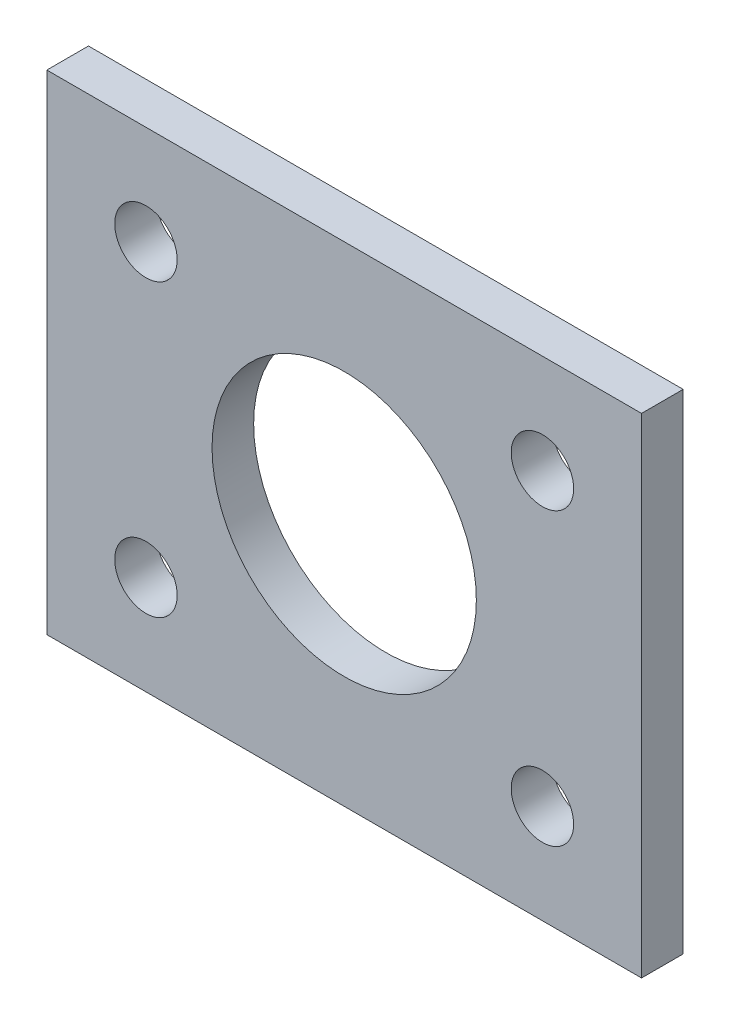
ISO-10303-21;
HEADER;
FILE_DESCRIPTION(('STEP AP214'),'2;1');
FILE_NAME('part.step','',(''),(''),'','','');
FILE_SCHEMA(('AUTOMOTIVE_DESIGN { 1 0 10303 214 1 1 1 1 }'));
ENDSEC;
DATA;
#1=APPLICATION_CONTEXT('core data for automotive mechanical design processes');
#2=APPLICATION_PROTOCOL_DEFINITION('international standard','automotive_design',2000,#1);
#3=PRODUCT_CONTEXT('',#1,'mechanical');
#4=PRODUCT('Part','Part','',(#3));
#5=PRODUCT_RELATED_PRODUCT_CATEGORY('part','',(#4));
#6=PRODUCT_DEFINITION_FORMATION('','',#4);
#7=PRODUCT_DEFINITION_CONTEXT('part definition',#1,'design');
#8=PRODUCT_DEFINITION('design','',#6,#7);
#9=PRODUCT_DEFINITION_SHAPE('','',#8);
#10=(LENGTH_UNIT() NAMED_UNIT(*) SI_UNIT(.MILLI.,.METRE.));
#11=(NAMED_UNIT(*) PLANE_ANGLE_UNIT() SI_UNIT($,.RADIAN.));
#12=(NAMED_UNIT(*) SI_UNIT($,.STERADIAN.) SOLID_ANGLE_UNIT());
#13=UNCERTAINTY_MEASURE_WITH_UNIT(LENGTH_MEASURE(1.E-05),#10,'distance_accuracy_value','');
#14=(GEOMETRIC_REPRESENTATION_CONTEXT(3) GLOBAL_UNCERTAINTY_ASSIGNED_CONTEXT((#13)) GLOBAL_UNIT_ASSIGNED_CONTEXT((#10,
#11,#12)) REPRESENTATION_CONTEXT('',''));
#15=CARTESIAN_POINT('',(0.,0.,0.));
#16=DIRECTION('',(0.,0.,1.));
#17=DIRECTION('',(1.,0.,0.));
#18=AXIS2_PLACEMENT_3D('',#15,#16,#17);
#19=CARTESIAN_POINT('',(0.,0.,2.));
#20=DIRECTION('',(0.,0.,1.));
#21=DIRECTION('',(1.,0.,0.));
#22=AXIS2_PLACEMENT_3D('',#19,#20,#21);
#23=PLANE('',#22);
#24=CARTESIAN_POINT('',(9.525,-6.985,2.));
#25=DIRECTION('',(0.,0.,1.));
#26=DIRECTION('',(1.,0.,0.));
#27=AXIS2_PLACEMENT_3D('',#24,#25,#26);
#28=CIRCLE('',#27,1.5);
#29=CARTESIAN_POINT('',(11.025,-6.985,2.));
#30=VERTEX_POINT('',#29);
#31=EDGE_CURVE('E131',#30,#30,#28,.T.);
#32=ORIENTED_EDGE('',*,*,#31,.F.);
#33=EDGE_LOOP('',(#32));
#34=FACE_BOUND('',#33,.T.);
#35=CARTESIAN_POINT('',(9.525,6.985,2.));
#36=DIRECTION('',(0.,0.,1.));
#37=DIRECTION('',(1.,0.,0.));
#38=AXIS2_PLACEMENT_3D('',#35,#36,#37);
#39=CIRCLE('',#38,1.5);
#40=CARTESIAN_POINT('',(11.025,6.985,2.));
#41=VERTEX_POINT('',#40);
#42=EDGE_CURVE('E119',#41,#41,#39,.T.);
#43=ORIENTED_EDGE('',*,*,#42,.F.);
#44=EDGE_LOOP('',(#43));
#45=FACE_BOUND('',#44,.T.);
#46=DIRECTION('',(0.,1.,0.));
#47=VECTOR('',#46,1.);
#48=CARTESIAN_POINT('',(14.2875,11.7475,2.));
#49=LINE('',#48,#47);
#50=CARTESIAN_POINT('',(14.2875,-11.7475,2.));
#51=VERTEX_POINT('',#50);
#52=CARTESIAN_POINT('',(14.2875,11.7475,2.));
#53=VERTEX_POINT('',#52);
#54=EDGE_CURVE('E89',#51,#53,#49,.T.);
#55=ORIENTED_EDGE('',*,*,#54,.T.);
#56=DIRECTION('',(-1.,0.,0.));
#57=VECTOR('',#56,1.);
#58=CARTESIAN_POINT('',(-14.2875,11.7475,2.));
#59=LINE('',#58,#57);
#60=CARTESIAN_POINT('',(-14.2875,11.7475,2.));
#61=VERTEX_POINT('',#60);
#62=EDGE_CURVE('E84',#53,#61,#59,.T.);
#63=ORIENTED_EDGE('',*,*,#62,.T.);
#64=DIRECTION('',(0.,-1.,0.));
#65=VECTOR('',#64,1.);
#66=CARTESIAN_POINT('',(-14.2875,11.7475,2.));
#67=LINE('',#66,#65);
#68=CARTESIAN_POINT('',(-14.2875,-11.7475,2.));
#69=VERTEX_POINT('',#68);
#70=EDGE_CURVE('E87',#61,#69,#67,.T.);
#71=ORIENTED_EDGE('',*,*,#70,.T.);
#72=DIRECTION('',(1.,0.,0.));
#73=VECTOR('',#72,1.);
#74=CARTESIAN_POINT('',(-14.2875,-11.7475,2.));
#75=LINE('',#74,#73);
#76=EDGE_CURVE('E54',#69,#51,#75,.T.);
#77=ORIENTED_EDGE('',*,*,#76,.T.);
#78=EDGE_LOOP('',(#55,#63,#71,#77));
#79=FACE_BOUND('',#78,.T.);
#80=CARTESIAN_POINT('',(-9.525,6.985,2.));
#81=DIRECTION('',(0.,0.,1.));
#82=DIRECTION('',(1.,0.,0.));
#83=AXIS2_PLACEMENT_3D('',#80,#81,#82);
#84=CIRCLE('',#83,1.5);
#85=CARTESIAN_POINT('',(-8.025,6.985,2.));
#86=VERTEX_POINT('',#85);
#87=EDGE_CURVE('E104',#86,#86,#84,.T.);
#88=ORIENTED_EDGE('',*,*,#87,.F.);
#89=EDGE_LOOP('',(#88));
#90=FACE_BOUND('',#89,.T.);
#91=CARTESIAN_POINT('',(-9.525,-6.985,2.));
#92=DIRECTION('',(0.,0.,1.));
#93=DIRECTION('',(1.,0.,0.));
#94=AXIS2_PLACEMENT_3D('',#91,#92,#93);
#95=CIRCLE('',#94,1.5);
#96=CARTESIAN_POINT('',(-8.025,-6.985,2.));
#97=VERTEX_POINT('',#96);
#98=EDGE_CURVE('E125',#97,#97,#95,.T.);
#99=ORIENTED_EDGE('',*,*,#98,.F.);
#100=EDGE_LOOP('',(#99));
#101=FACE_BOUND('',#100,.T.);
#102=CARTESIAN_POINT('',(0.,0.,2.));
#103=DIRECTION('',(0.,0.,1.));
#104=DIRECTION('',(1.,0.,0.));
#105=AXIS2_PLACEMENT_3D('',#102,#103,#104);
#106=CIRCLE('',#105,6.35);
#107=CARTESIAN_POINT('',(6.35,0.,2.));
#108=VERTEX_POINT('',#107);
#109=EDGE_CURVE('E137',#108,#108,#106,.T.);
#110=ORIENTED_EDGE('',*,*,#109,.F.);
#111=EDGE_LOOP('',(#110));
#112=FACE_BOUND('',#111,.T.);
#113=ADVANCED_FACE('F37',(#34,#45,#79,#90,#101,#112),#23,.T.);
#114=CARTESIAN_POINT('',(0.,0.,0.));
#115=DIRECTION('',(0.,0.,1.));
#116=DIRECTION('',(1.,0.,0.));
#117=AXIS2_PLACEMENT_3D('',#114,#115,#116);
#118=PLANE('',#117);
#119=DIRECTION('',(0.,1.,0.));
#120=VECTOR('',#119,1.);
#121=CARTESIAN_POINT('',(14.2875,11.7475,0.));
#122=LINE('',#121,#120);
#123=CARTESIAN_POINT('',(14.2875,-11.7475,0.));
#124=VERTEX_POINT('',#123);
#125=CARTESIAN_POINT('',(14.2875,11.7475,0.));
#126=VERTEX_POINT('',#125);
#127=EDGE_CURVE('E101',#124,#126,#122,.T.);
#128=ORIENTED_EDGE('',*,*,#127,.F.);
#129=DIRECTION('',(1.,0.,0.));
#130=VECTOR('',#129,1.);
#131=CARTESIAN_POINT('',(-14.2875,-11.7475,0.));
#132=LINE('',#131,#130);
#133=CARTESIAN_POINT('',(-14.2875,-11.7475,0.));
#134=VERTEX_POINT('',#133);
#135=EDGE_CURVE('E77',#134,#124,#132,.T.);
#136=ORIENTED_EDGE('',*,*,#135,.F.);
#137=DIRECTION('',(0.,-1.,0.));
#138=VECTOR('',#137,1.);
#139=CARTESIAN_POINT('',(-14.2875,11.7475,0.));
#140=LINE('',#139,#138);
#141=CARTESIAN_POINT('',(-14.2875,11.7475,0.));
#142=VERTEX_POINT('',#141);
#143=EDGE_CURVE('E71',#142,#134,#140,.T.);
#144=ORIENTED_EDGE('',*,*,#143,.F.);
#145=DIRECTION('',(-1.,0.,0.));
#146=VECTOR('',#145,1.);
#147=CARTESIAN_POINT('',(-14.2875,11.7475,0.));
#148=LINE('',#147,#146);
#149=EDGE_CURVE('E93',#126,#142,#148,.T.);
#150=ORIENTED_EDGE('',*,*,#149,.F.);
#151=EDGE_LOOP('',(#128,#136,#144,#150));
#152=FACE_BOUND('',#151,.T.);
#153=CARTESIAN_POINT('',(-9.525,6.985,0.));
#154=DIRECTION('',(0.,0.,1.));
#155=DIRECTION('',(1.,0.,0.));
#156=AXIS2_PLACEMENT_3D('',#153,#154,#155);
#157=CIRCLE('',#156,1.5);
#158=CARTESIAN_POINT('',(-8.025,6.985,0.));
#159=VERTEX_POINT('',#158);
#160=EDGE_CURVE('E116',#159,#159,#157,.T.);
#161=ORIENTED_EDGE('',*,*,#160,.T.);
#162=EDGE_LOOP('',(#161));
#163=FACE_BOUND('',#162,.T.);
#164=CARTESIAN_POINT('',(9.525,6.985,0.));
#165=DIRECTION('',(0.,0.,1.));
#166=DIRECTION('',(1.,0.,0.));
#167=AXIS2_PLACEMENT_3D('',#164,#165,#166);
#168=CIRCLE('',#167,1.5);
#169=CARTESIAN_POINT('',(11.025,6.985,0.));
#170=VERTEX_POINT('',#169);
#171=EDGE_CURVE('E122',#170,#170,#168,.T.);
#172=ORIENTED_EDGE('',*,*,#171,.T.);
#173=EDGE_LOOP('',(#172));
#174=FACE_BOUND('',#173,.T.);
#175=CARTESIAN_POINT('',(-9.525,-6.985,0.));
#176=DIRECTION('',(0.,0.,1.));
#177=DIRECTION('',(1.,0.,0.));
#178=AXIS2_PLACEMENT_3D('',#175,#176,#177);
#179=CIRCLE('',#178,1.5);
#180=CARTESIAN_POINT('',(-8.025,-6.985,0.));
#181=VERTEX_POINT('',#180);
#182=EDGE_CURVE('E128',#181,#181,#179,.T.);
#183=ORIENTED_EDGE('',*,*,#182,.T.);
#184=EDGE_LOOP('',(#183));
#185=FACE_BOUND('',#184,.T.);
#186=CARTESIAN_POINT('',(9.525,-6.985,0.));
#187=DIRECTION('',(0.,0.,1.));
#188=DIRECTION('',(1.,0.,0.));
#189=AXIS2_PLACEMENT_3D('',#186,#187,#188);
#190=CIRCLE('',#189,1.5);
#191=CARTESIAN_POINT('',(11.025,-6.985,0.));
#192=VERTEX_POINT('',#191);
#193=EDGE_CURVE('E134',#192,#192,#190,.T.);
#194=ORIENTED_EDGE('',*,*,#193,.T.);
#195=EDGE_LOOP('',(#194));
#196=FACE_BOUND('',#195,.T.);
#197=CARTESIAN_POINT('',(0.,0.,0.));
#198=DIRECTION('',(0.,0.,1.));
#199=DIRECTION('',(1.,0.,0.));
#200=AXIS2_PLACEMENT_3D('',#197,#198,#199);
#201=CIRCLE('',#200,6.35);
#202=CARTESIAN_POINT('',(6.35,0.,0.));
#203=VERTEX_POINT('',#202);
#204=EDGE_CURVE('E140',#203,#203,#201,.T.);
#205=ORIENTED_EDGE('',*,*,#204,.T.);
#206=EDGE_LOOP('',(#205));
#207=FACE_BOUND('',#206,.T.);
#208=ADVANCED_FACE('F112',(#152,#163,#174,#185,#196,#207),#118,.F.);
#209=CARTESIAN_POINT('',(14.2875,11.7475,2.));
#210=DIRECTION('',(-1.,0.,0.));
#211=DIRECTION('',(0.,0.,1.));
#212=AXIS2_PLACEMENT_3D('',#209,#210,#211);
#213=PLANE('',#212);
#214=ORIENTED_EDGE('',*,*,#127,.T.);
#215=DIRECTION('',(0.,0.,-1.));
#216=VECTOR('',#215,1.);
#217=CARTESIAN_POINT('',(14.2875,11.7475,2.));
#218=LINE('',#217,#216);
#219=EDGE_CURVE('E11',#53,#126,#218,.T.);
#220=ORIENTED_EDGE('',*,*,#219,.F.);
#221=ORIENTED_EDGE('',*,*,#54,.F.);
#222=DIRECTION('',(0.,0.,-1.));
#223=VECTOR('',#222,1.);
#224=CARTESIAN_POINT('',(14.2875,-11.7475,2.));
#225=LINE('',#224,#223);
#226=EDGE_CURVE('E97',#51,#124,#225,.T.);
#227=ORIENTED_EDGE('',*,*,#226,.T.);
#228=EDGE_LOOP('',(#214,#220,#221,#227));
#229=FACE_BOUND('',#228,.T.);
#230=ADVANCED_FACE('F39',(#229),#213,.F.);
#231=CARTESIAN_POINT('',(-14.2875,11.7475,2.));
#232=DIRECTION('',(0.,-1.,0.));
#233=DIRECTION('',(0.,0.,-1.));
#234=AXIS2_PLACEMENT_3D('',#231,#232,#233);
#235=PLANE('',#234);
#236=ORIENTED_EDGE('',*,*,#149,.T.);
#237=DIRECTION('',(0.,0.,-1.));
#238=VECTOR('',#237,1.);
#239=CARTESIAN_POINT('',(-14.2875,11.7475,2.));
#240=LINE('',#239,#238);
#241=EDGE_CURVE('E46',#61,#142,#240,.T.);
#242=ORIENTED_EDGE('',*,*,#241,.F.);
#243=ORIENTED_EDGE('',*,*,#62,.F.);
#244=ORIENTED_EDGE('',*,*,#219,.T.);
#245=EDGE_LOOP('',(#236,#242,#243,#244));
#246=FACE_BOUND('',#245,.T.);
#247=ADVANCED_FACE('F92',(#246),#235,.F.);
#248=CARTESIAN_POINT('',(-14.2875,11.7475,2.));
#249=DIRECTION('',(1.,0.,0.));
#250=DIRECTION('',(0.,0.,-1.));
#251=AXIS2_PLACEMENT_3D('',#248,#249,#250);
#252=PLANE('',#251);
#253=ORIENTED_EDGE('',*,*,#143,.T.);
#254=DIRECTION('',(0.,0.,-1.));
#255=VECTOR('',#254,1.);
#256=CARTESIAN_POINT('',(-14.2875,-11.7475,2.));
#257=LINE('',#256,#255);
#258=EDGE_CURVE('E94',#69,#134,#257,.T.);
#259=ORIENTED_EDGE('',*,*,#258,.F.);
#260=ORIENTED_EDGE('',*,*,#70,.F.);
#261=ORIENTED_EDGE('',*,*,#241,.T.);
#262=EDGE_LOOP('',(#253,#259,#260,#261));
#263=FACE_BOUND('',#262,.T.);
#264=ADVANCED_FACE('F95',(#263),#252,.F.);
#265=CARTESIAN_POINT('',(-14.2875,-11.7475,2.));
#266=DIRECTION('',(0.,1.,0.));
#267=DIRECTION('',(0.,0.,1.));
#268=AXIS2_PLACEMENT_3D('',#265,#266,#267);
#269=PLANE('',#268);
#270=ORIENTED_EDGE('',*,*,#135,.T.);
#271=ORIENTED_EDGE('',*,*,#226,.F.);
#272=ORIENTED_EDGE('',*,*,#76,.F.);
#273=ORIENTED_EDGE('',*,*,#258,.T.);
#274=EDGE_LOOP('',(#270,#271,#272,#273));
#275=FACE_BOUND('',#274,.T.);
#276=ADVANCED_FACE('F109',(#275),#269,.F.);
#277=CARTESIAN_POINT('',(-9.525,6.985,2.));
#278=DIRECTION('',(0.,0.,-1.));
#279=DIRECTION('',(-1.,0.,0.));
#280=AXIS2_PLACEMENT_3D('',#277,#278,#279);
#281=CYLINDRICAL_SURFACE('',#280,1.5);
#282=ORIENTED_EDGE('',*,*,#87,.T.);
#283=EDGE_LOOP('',(#282));
#284=FACE_BOUND('',#283,.T.);
#285=ORIENTED_EDGE('',*,*,#160,.F.);
#286=EDGE_LOOP('',(#285));
#287=FACE_BOUND('',#286,.T.);
#288=ADVANCED_FACE('F159',(#284,#287),#281,.F.);
#289=CARTESIAN_POINT('',(9.525,6.985,2.));
#290=DIRECTION('',(0.,0.,-1.));
#291=DIRECTION('',(-1.,0.,0.));
#292=AXIS2_PLACEMENT_3D('',#289,#290,#291);
#293=CYLINDRICAL_SURFACE('',#292,1.5);
#294=ORIENTED_EDGE('',*,*,#42,.T.);
#295=EDGE_LOOP('',(#294));
#296=FACE_BOUND('',#295,.T.);
#297=ORIENTED_EDGE('',*,*,#171,.F.);
#298=EDGE_LOOP('',(#297));
#299=FACE_BOUND('',#298,.T.);
#300=ADVANCED_FACE('F205',(#296,#299),#293,.F.);
#301=CARTESIAN_POINT('',(-9.525,-6.985,2.));
#302=DIRECTION('',(0.,0.,-1.));
#303=DIRECTION('',(-1.,0.,0.));
#304=AXIS2_PLACEMENT_3D('',#301,#302,#303);
#305=CYLINDRICAL_SURFACE('',#304,1.5);
#306=ORIENTED_EDGE('',*,*,#98,.T.);
#307=EDGE_LOOP('',(#306));
#308=FACE_BOUND('',#307,.T.);
#309=ORIENTED_EDGE('',*,*,#182,.F.);
#310=EDGE_LOOP('',(#309));
#311=FACE_BOUND('',#310,.T.);
#312=ADVANCED_FACE('F213',(#308,#311),#305,.F.);
#313=CARTESIAN_POINT('',(9.525,-6.985,2.));
#314=DIRECTION('',(0.,0.,-1.));
#315=DIRECTION('',(-1.,0.,0.));
#316=AXIS2_PLACEMENT_3D('',#313,#314,#315);
#317=CYLINDRICAL_SURFACE('',#316,1.5);
#318=ORIENTED_EDGE('',*,*,#31,.T.);
#319=EDGE_LOOP('',(#318));
#320=FACE_BOUND('',#319,.T.);
#321=ORIENTED_EDGE('',*,*,#193,.F.);
#322=EDGE_LOOP('',(#321));
#323=FACE_BOUND('',#322,.T.);
#324=ADVANCED_FACE('F221',(#320,#323),#317,.F.);
#325=CARTESIAN_POINT('',(0.,0.,2.));
#326=DIRECTION('',(0.,0.,-1.));
#327=DIRECTION('',(-1.,0.,0.));
#328=AXIS2_PLACEMENT_3D('',#325,#326,#327);
#329=CYLINDRICAL_SURFACE('',#328,6.35);
#330=ORIENTED_EDGE('',*,*,#109,.T.);
#331=EDGE_LOOP('',(#330));
#332=FACE_BOUND('',#331,.T.);
#333=ORIENTED_EDGE('',*,*,#204,.F.);
#334=EDGE_LOOP('',(#333));
#335=FACE_BOUND('',#334,.T.);
#336=ADVANCED_FACE('F146',(#332,#335),#329,.F.);
#337=CLOSED_SHELL('',(#113,#208,#230,#247,#264,#276,#288,#300,#312,#324,#336));
#338=MANIFOLD_SOLID_BREP('B2',#337);
#339=ADVANCED_BREP_SHAPE_REPRESENTATION('',(#18,#338),#14);
#340=SHAPE_DEFINITION_REPRESENTATION(#9,#339);
ENDSEC;
END-ISO-10303-21;
